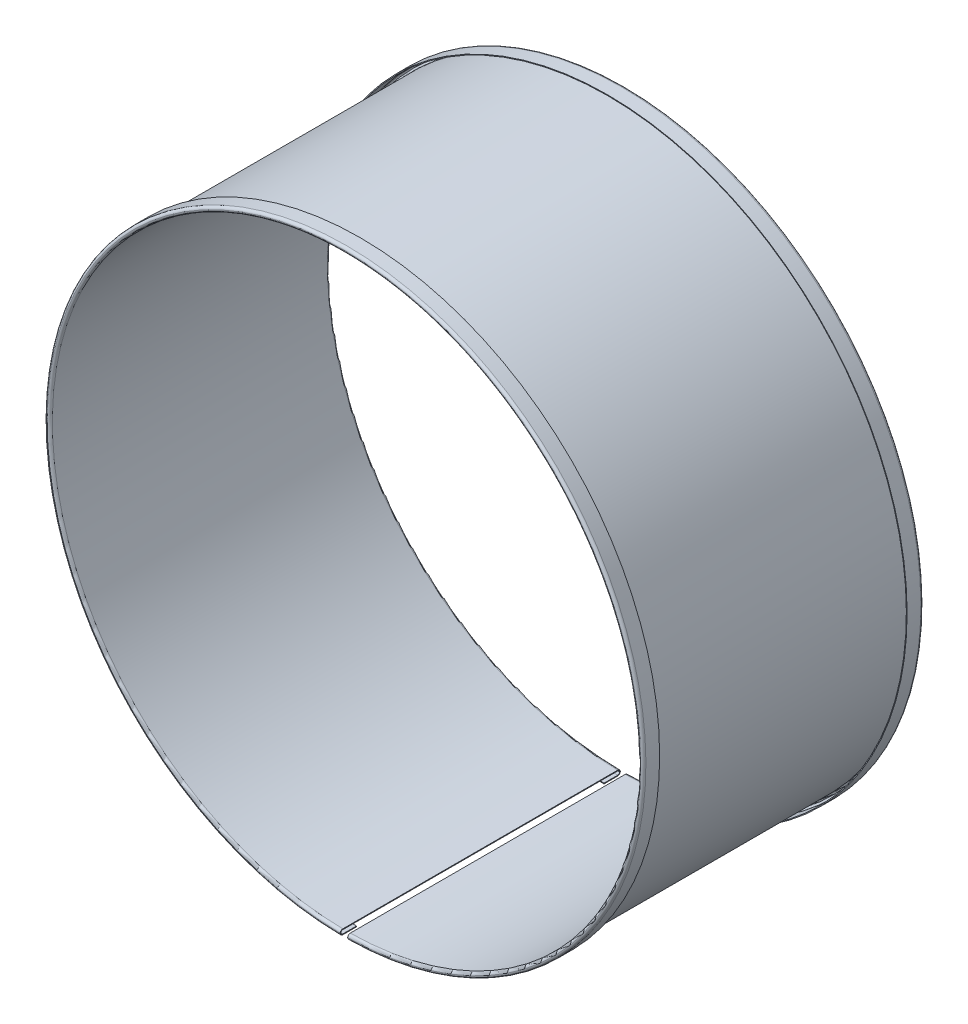
ISO-10303-21;
HEADER;
FILE_DESCRIPTION(('STEP AP214'),'2;1');
FILE_NAME('part.step','',(''),(''),'','','');
FILE_SCHEMA(('AUTOMOTIVE_DESIGN { 1 0 10303 214 1 1 1 1 }'));
ENDSEC;
DATA;
#1=APPLICATION_CONTEXT('core data for automotive mechanical design processes');
#2=APPLICATION_PROTOCOL_DEFINITION('international standard','automotive_design',2000,#1);
#3=PRODUCT_CONTEXT('',#1,'mechanical');
#4=PRODUCT('Part','Part','',(#3));
#5=PRODUCT_RELATED_PRODUCT_CATEGORY('part','',(#4));
#6=PRODUCT_DEFINITION_FORMATION('','',#4);
#7=PRODUCT_DEFINITION_CONTEXT('part definition',#1,'design');
#8=PRODUCT_DEFINITION('design','',#6,#7);
#9=PRODUCT_DEFINITION_SHAPE('','',#8);
#10=(LENGTH_UNIT() NAMED_UNIT(*) SI_UNIT(.MILLI.,.METRE.));
#11=(NAMED_UNIT(*) PLANE_ANGLE_UNIT() SI_UNIT($,.RADIAN.));
#12=(NAMED_UNIT(*) SI_UNIT($,.STERADIAN.) SOLID_ANGLE_UNIT());
#13=UNCERTAINTY_MEASURE_WITH_UNIT(LENGTH_MEASURE(1.E-05),#10,'distance_accuracy_value','');
#14=(GEOMETRIC_REPRESENTATION_CONTEXT(3) GLOBAL_UNCERTAINTY_ASSIGNED_CONTEXT((#13)) GLOBAL_UNIT_ASSIGNED_CONTEXT((#10,
#11,#12)) REPRESENTATION_CONTEXT('',''));
#15=CARTESIAN_POINT('',(0.,0.,0.));
#16=DIRECTION('',(0.,0.,1.));
#17=DIRECTION('',(1.,0.,0.));
#18=AXIS2_PLACEMENT_3D('',#15,#16,#17);
#19=CARTESIAN_POINT('',(2.01259615598009,-159.765923063494,-74.));
#20=DIRECTION('',(-0.999920665280262,-0.012596155980198,0.));
#21=DIRECTION('',(0.012596155980198,-0.999920665280262,0.));
#22=AXIS2_PLACEMENT_3D('',#19,#20,#21);
#23=PLANE('',#22);
#24=DIRECTION('',(0.0125961559801985,-0.999920665280262,0.));
#25=VECTOR('',#24,1.);
#26=CARTESIAN_POINT('',(2.02519231196033,-160.765843728774,-74.));
#27=LINE('',#26,#25);
#28=CARTESIAN_POINT('',(2.02519231196033,-160.765843728774,-74.));
#29=VERTEX_POINT('',#28);
#30=CARTESIAN_POINT('',(2.03023077435238,-161.165811994887,-74.));
#31=VERTEX_POINT('',#30);
#32=EDGE_CURVE('E11',#29,#31,#27,.T.);
#33=ORIENTED_EDGE('',*,*,#32,.F.);
#34=CARTESIAN_POINT('',(2.01259615598009,-159.765923063494,-74.));
#35=DIRECTION('',(0.999920665280262,0.012596155980198,0.));
#36=DIRECTION('',(-0.012596155980198,0.999920665280262,0.));
#37=AXIS2_PLACEMENT_3D('',#34,#35,#36);
#38=CIRCLE('',#37,1.);
#39=CARTESIAN_POINT('',(2.01259615598013,-159.765923063494,-75.));
#40=VERTEX_POINT('',#39);
#41=EDGE_CURVE('E182',#40,#29,#38,.F.);
#42=ORIENTED_EDGE('',*,*,#41,.F.);
#43=DIRECTION('',(0.,0.,-1.));
#44=VECTOR('',#43,1.);
#45=CARTESIAN_POINT('',(2.01259615598013,-159.765923063494,-75.));
#46=LINE('',#45,#44);
#47=CARTESIAN_POINT('',(2.0125961559801,-159.765923063494,-75.4));
#48=VERTEX_POINT('',#47);
#49=EDGE_CURVE('E47',#40,#48,#46,.T.);
#50=ORIENTED_EDGE('',*,*,#49,.T.);
#51=CARTESIAN_POINT('',(2.0125961559801,-159.765923063494,-74.));
#52=DIRECTION('',(0.999920665280262,0.0125961559801982,0.));
#53=DIRECTION('',(-0.0125961559801982,0.999920665280262,0.));
#54=AXIS2_PLACEMENT_3D('',#51,#52,#53);
#55=CIRCLE('',#54,1.4);
#56=EDGE_CURVE('E179',#48,#31,#55,.F.);
#57=ORIENTED_EDGE('',*,*,#56,.T.);
#58=EDGE_LOOP('',(#33,#42,#50,#57));
#59=FACE_BOUND('',#58,.T.);
#60=ADVANCED_FACE('F37',(#59),#23,.T.);
#61=CARTESIAN_POINT('',(2.01259615598009,-159.765923063494,-74.));
#62=DIRECTION('',(-0.999920665280262,-0.012596155980198,0.));
#63=DIRECTION('',(0.012596155980198,-0.999920665280262,0.));
#64=AXIS2_PLACEMENT_3D('',#61,#62,#63);
#65=PLANE('',#64);
#66=ORIENTED_EDGE('',*,*,#49,.F.);
#67=CARTESIAN_POINT('',(2.01259615598009,-159.765923063494,-74.));
#68=DIRECTION('',(0.999920665280262,0.012596155980198,0.));
#69=DIRECTION('',(-0.012596155980198,0.999920665280262,0.));
#70=AXIS2_PLACEMENT_3D('',#67,#68,#69);
#71=CIRCLE('',#70,1.);
#72=CARTESIAN_POINT('',(1.99999999999993,-158.766002398214,-74.));
#73=VERTEX_POINT('',#72);
#74=EDGE_CURVE('E294',#73,#40,#71,.F.);
#75=ORIENTED_EDGE('',*,*,#74,.F.);
#76=DIRECTION('',(-0.0125961559801984,0.999920665280262,0.));
#77=VECTOR('',#76,1.);
#78=CARTESIAN_POINT('',(1.99999999999993,-158.766002398214,-74.));
#79=LINE('',#78,#77);
#80=CARTESIAN_POINT('',(1.99496153760783,-158.366034132102,-74.));
#81=VERTEX_POINT('',#80);
#82=EDGE_CURVE('E171',#73,#81,#79,.T.);
#83=ORIENTED_EDGE('',*,*,#82,.T.);
#84=CARTESIAN_POINT('',(2.0125961559801,-159.765923063494,-74.));
#85=DIRECTION('',(0.999920665280262,0.0125961559801982,0.));
#86=DIRECTION('',(-0.0125961559801982,0.999920665280262,0.));
#87=AXIS2_PLACEMENT_3D('',#84,#85,#86);
#88=CIRCLE('',#87,1.4);
#89=EDGE_CURVE('E199',#81,#48,#88,.F.);
#90=ORIENTED_EDGE('',*,*,#89,.T.);
#91=EDGE_LOOP('',(#66,#75,#83,#90));
#92=FACE_BOUND('',#91,.T.);
#93=ADVANCED_FACE('F200',(#92),#65,.T.);
#94=CARTESIAN_POINT('',(1.9999999999999,-158.766002398214,0.));
#95=DIRECTION('',(-0.999920665280262,-0.0125961559801982,0.));
#96=DIRECTION('',(0.,0.,-1.));
#97=AXIS2_PLACEMENT_3D('',#94,#95,#96);
#98=PLANE('',#97);
#99=ORIENTED_EDGE('',*,*,#82,.F.);
#100=DIRECTION('',(0.,0.,-1.));
#101=VECTOR('',#100,1.);
#102=CARTESIAN_POINT('',(1.9999999999999,-158.766002398214,75.));
#103=LINE('',#102,#101);
#104=CARTESIAN_POINT('',(1.99999999999993,-158.766002398214,74.));
#105=VERTEX_POINT('',#104);
#106=EDGE_CURVE('E285',#105,#73,#103,.T.);
#107=ORIENTED_EDGE('',*,*,#106,.F.);
#108=DIRECTION('',(-0.0125961559801984,0.999920665280262,0.));
#109=VECTOR('',#108,1.);
#110=CARTESIAN_POINT('',(1.99999999999993,-158.766002398214,74.));
#111=LINE('',#110,#109);
#112=CARTESIAN_POINT('',(1.99496153760783,-158.366034132102,74.));
#113=VERTEX_POINT('',#112);
#114=EDGE_CURVE('E168',#105,#113,#111,.T.);
#115=ORIENTED_EDGE('',*,*,#114,.T.);
#116=DIRECTION('',(0.,0.,-1.));
#117=VECTOR('',#116,1.);
#118=CARTESIAN_POINT('',(1.99496153760783,-158.366034132102,0.));
#119=LINE('',#118,#117);
#120=EDGE_CURVE('E216',#113,#81,#119,.T.);
#121=ORIENTED_EDGE('',*,*,#120,.T.);
#122=EDGE_LOOP('',(#99,#107,#115,#121));
#123=FACE_BOUND('',#122,.T.);
#124=ADVANCED_FACE('F330',(#123),#98,.T.);
#125=CARTESIAN_POINT('',(2.01259615598009,-159.765923063494,74.));
#126=DIRECTION('',(-0.999920665280262,-0.0125961559801981,0.));
#127=DIRECTION('',(0.0125961559801981,-0.999920665280262,0.));
#128=AXIS2_PLACEMENT_3D('',#125,#126,#127);
#129=PLANE('',#128);
#130=ORIENTED_EDGE('',*,*,#114,.F.);
#131=CARTESIAN_POINT('',(2.01259615598009,-159.765923063494,74.));
#132=DIRECTION('',(0.999920665280262,0.0125961559801981,0.));
#133=DIRECTION('',(-0.0125961559801981,0.999920665280262,0.));
#134=AXIS2_PLACEMENT_3D('',#131,#132,#133);
#135=CIRCLE('',#134,1.);
#136=CARTESIAN_POINT('',(2.01259615598013,-159.765923063494,75.));
#137=VERTEX_POINT('',#136);
#138=EDGE_CURVE('E276',#137,#105,#135,.F.);
#139=ORIENTED_EDGE('',*,*,#138,.F.);
#140=DIRECTION('',(0.,0.,1.));
#141=VECTOR('',#140,1.);
#142=CARTESIAN_POINT('',(2.01259615598013,-159.765923063494,75.));
#143=LINE('',#142,#141);
#144=CARTESIAN_POINT('',(2.01259615598011,-159.765923063494,75.4));
#145=VERTEX_POINT('',#144);
#146=EDGE_CURVE('E165',#137,#145,#143,.T.);
#147=ORIENTED_EDGE('',*,*,#146,.T.);
#148=CARTESIAN_POINT('',(2.0125961559801,-159.765923063494,74.));
#149=DIRECTION('',(0.999920665280262,0.0125961559801982,0.));
#150=DIRECTION('',(-0.0125961559801982,0.999920665280262,0.));
#151=AXIS2_PLACEMENT_3D('',#148,#149,#150);
#152=CIRCLE('',#151,1.4);
#153=EDGE_CURVE('E220',#145,#113,#152,.F.);
#154=ORIENTED_EDGE('',*,*,#153,.T.);
#155=EDGE_LOOP('',(#130,#139,#147,#154));
#156=FACE_BOUND('',#155,.T.);
#157=ADVANCED_FACE('F338',(#156),#129,.T.);
#158=CARTESIAN_POINT('',(2.01259615598009,-159.765923063494,74.));
#159=DIRECTION('',(-0.999920665280262,-0.0125961559801981,0.));
#160=DIRECTION('',(0.0125961559801981,-0.999920665280262,0.));
#161=AXIS2_PLACEMENT_3D('',#158,#159,#160);
#162=PLANE('',#161);
#163=ORIENTED_EDGE('',*,*,#146,.F.);
#164=CARTESIAN_POINT('',(2.01259615598009,-159.765923063494,74.));
#165=DIRECTION('',(0.999920665280262,0.0125961559801981,0.));
#166=DIRECTION('',(-0.0125961559801981,0.999920665280262,0.));
#167=AXIS2_PLACEMENT_3D('',#164,#165,#166);
#168=CIRCLE('',#167,1.);
#169=CARTESIAN_POINT('',(2.02519231196033,-160.765843728774,74.));
#170=VERTEX_POINT('',#169);
#171=EDGE_CURVE('E265',#170,#137,#168,.F.);
#172=ORIENTED_EDGE('',*,*,#171,.F.);
#173=DIRECTION('',(0.0125961559801984,-0.999920665280262,0.));
#174=VECTOR('',#173,1.);
#175=CARTESIAN_POINT('',(2.02519231196033,-160.765843728774,74.));
#176=LINE('',#175,#174);
#177=CARTESIAN_POINT('',(2.03023077435238,-161.165811994887,74.));
#178=VERTEX_POINT('',#177);
#179=EDGE_CURVE('E162',#170,#178,#176,.T.);
#180=ORIENTED_EDGE('',*,*,#179,.T.);
#181=CARTESIAN_POINT('',(2.0125961559801,-159.765923063494,74.));
#182=DIRECTION('',(0.999920665280262,0.0125961559801982,0.));
#183=DIRECTION('',(-0.0125961559801982,0.999920665280262,0.));
#184=AXIS2_PLACEMENT_3D('',#181,#182,#183);
#185=CIRCLE('',#184,1.4);
#186=EDGE_CURVE('E224',#178,#145,#185,.F.);
#187=ORIENTED_EDGE('',*,*,#186,.T.);
#188=EDGE_LOOP('',(#163,#172,#180,#187));
#189=FACE_BOUND('',#188,.T.);
#190=ADVANCED_FACE('F374',(#189),#162,.T.);
#191=CARTESIAN_POINT('',(2.02519231196029,-160.765843728774,70.305));
#192=DIRECTION('',(0.999920665280262,0.0125961559801982,0.));
#193=DIRECTION('',(0.,0.,1.));
#194=AXIS2_PLACEMENT_3D('',#191,#192,#193);
#195=PLANE('',#194);
#196=ORIENTED_EDGE('',*,*,#179,.F.);
#197=DIRECTION('',(0.,0.,1.));
#198=VECTOR('',#197,1.);
#199=CARTESIAN_POINT('',(2.02519231196029,-160.765843728774,75.));
#200=LINE('',#199,#198);
#201=CARTESIAN_POINT('',(2.02519231196033,-160.765843728774,66.61));
#202=VERTEX_POINT('',#201);
#203=EDGE_CURVE('E259',#202,#170,#200,.T.);
#204=ORIENTED_EDGE('',*,*,#203,.F.);
#205=DIRECTION('',(0.0125961559801984,-0.999920665280262,0.));
#206=VECTOR('',#205,1.);
#207=CARTESIAN_POINT('',(2.02519231196033,-160.765843728774,66.61));
#208=LINE('',#207,#206);
#209=CARTESIAN_POINT('',(2.03023077435238,-161.165811994887,66.61));
#210=VERTEX_POINT('',#209);
#211=EDGE_CURVE('E159',#202,#210,#208,.T.);
#212=ORIENTED_EDGE('',*,*,#211,.T.);
#213=DIRECTION('',(0.,0.,-1.));
#214=VECTOR('',#213,1.);
#215=CARTESIAN_POINT('',(2.03023077435238,-161.165811994887,0.));
#216=LINE('',#215,#214);
#217=EDGE_CURVE('E228',#210,#178,#216,.F.);
#218=ORIENTED_EDGE('',*,*,#217,.T.);
#219=EDGE_LOOP('',(#196,#204,#212,#218));
#220=FACE_BOUND('',#219,.T.);
#221=ADVANCED_FACE('F404',(#220),#195,.F.);
#222=CARTESIAN_POINT('',(0.,0.,66.61));
#223=DIRECTION('',(0.,0.,1.));
#224=DIRECTION('',(1.,0.,0.));
#225=AXIS2_PLACEMENT_3D('',#222,#223,#224);
#226=PLANE('',#225);
#227=ORIENTED_EDGE('',*,*,#211,.F.);
#228=CARTESIAN_POINT('',(0.,0.,66.61));
#229=DIRECTION('',(0.,0.,-1.));
#230=DIRECTION('',(-0.0125961559801988,-0.999920665280262,0.));
#231=AXIS2_PLACEMENT_3D('',#228,#229,#230);
#232=CIRCLE('',#231,160.77859905387);
#233=CARTESIAN_POINT('',(-2.0251923119604,-160.765843728774,66.61));
#234=VERTEX_POINT('',#233);
#235=EDGE_CURVE('E125',#234,#202,#232,.T.);
#236=ORIENTED_EDGE('',*,*,#235,.F.);
#237=DIRECTION('',(-0.0125961559801988,-0.999920665280262,0.));
#238=VECTOR('',#237,1.);
#239=CARTESIAN_POINT('',(-2.0251923119604,-160.765843728774,66.61));
#240=LINE('',#239,#238);
#241=CARTESIAN_POINT('',(-2.03023077435247,-161.165811994887,66.61));
#242=VERTEX_POINT('',#241);
#243=EDGE_CURVE('E156',#234,#242,#240,.T.);
#244=ORIENTED_EDGE('',*,*,#243,.T.);
#245=CARTESIAN_POINT('',(0.,0.,66.61));
#246=DIRECTION('',(0.,0.,-1.));
#247=DIRECTION('',(-1.,0.,0.));
#248=AXIS2_PLACEMENT_3D('',#245,#246,#247);
#249=CIRCLE('',#248,161.17859905387);
#250=EDGE_CURVE('E233',#242,#210,#249,.T.);
#251=ORIENTED_EDGE('',*,*,#250,.T.);
#252=EDGE_LOOP('',(#227,#236,#244,#251));
#253=FACE_BOUND('',#252,.T.);
#254=ADVANCED_FACE('F407',(#253),#226,.F.);
#255=CARTESIAN_POINT('',(-2.0251923119604,-160.765843728774,70.305));
#256=DIRECTION('',(0.999920665280262,-0.0125961559801988,0.));
#257=DIRECTION('',(0.,0.,1.));
#258=AXIS2_PLACEMENT_3D('',#255,#256,#257);
#259=PLANE('',#258);
#260=ORIENTED_EDGE('',*,*,#243,.F.);
#261=DIRECTION('',(0.,0.,1.));
#262=VECTOR('',#261,1.);
#263=CARTESIAN_POINT('',(-2.0251923119604,-160.765843728774,75.));
#264=LINE('',#263,#262);
#265=CARTESIAN_POINT('',(-2.0251923119604,-160.765843728774,74.));
#266=VERTEX_POINT('',#265);
#267=EDGE_CURVE('E255',#234,#266,#264,.T.);
#268=ORIENTED_EDGE('',*,*,#267,.T.);
#269=DIRECTION('',(-0.0125961559801989,-0.999920665280262,0.));
#270=VECTOR('',#269,1.);
#271=CARTESIAN_POINT('',(-2.0251923119604,-160.765843728774,74.));
#272=LINE('',#271,#270);
#273=CARTESIAN_POINT('',(-2.03023077435247,-161.165811994887,74.));
#274=VERTEX_POINT('',#273);
#275=EDGE_CURVE('E153',#266,#274,#272,.T.);
#276=ORIENTED_EDGE('',*,*,#275,.T.);
#277=DIRECTION('',(0.,0.,-1.));
#278=VECTOR('',#277,1.);
#279=CARTESIAN_POINT('',(-2.03023077435247,-161.165811994887,0.));
#280=LINE('',#279,#278);
#281=EDGE_CURVE('E132',#242,#274,#280,.F.);
#282=ORIENTED_EDGE('',*,*,#281,.F.);
#283=EDGE_LOOP('',(#260,#268,#276,#282));
#284=FACE_BOUND('',#283,.T.);
#285=ADVANCED_FACE('F390',(#284),#259,.T.);
#286=CARTESIAN_POINT('',(-2.0125961559802,-159.765923063494,74.));
#287=DIRECTION('',(-0.999920665280262,0.0125961559801989,0.));
#288=DIRECTION('',(-0.0125961559801989,-0.999920665280262,0.));
#289=AXIS2_PLACEMENT_3D('',#286,#287,#288);
#290=PLANE('',#289);
#291=ORIENTED_EDGE('',*,*,#275,.F.);
#292=CARTESIAN_POINT('',(-2.0125961559802,-159.765923063494,74.));
#293=DIRECTION('',(0.999920665280262,-0.0125961559801989,0.));
#294=DIRECTION('',(0.0125961559801989,0.999920665280262,0.));
#295=AXIS2_PLACEMENT_3D('',#292,#293,#294);
#296=CIRCLE('',#295,1.);
#297=CARTESIAN_POINT('',(-2.0125961559802,-159.765923063494,75.));
#298=VERTEX_POINT('',#297);
#299=EDGE_CURVE('E258',#266,#298,#296,.F.);
#300=ORIENTED_EDGE('',*,*,#299,.T.);
#301=DIRECTION('',(0.,0.,1.));
#302=VECTOR('',#301,1.);
#303=CARTESIAN_POINT('',(-2.0125961559802,-159.765923063494,75.));
#304=LINE('',#303,#302);
#305=CARTESIAN_POINT('',(-2.01259615598019,-159.765923063494,75.4));
#306=VERTEX_POINT('',#305);
#307=EDGE_CURVE('E150',#298,#306,#304,.T.);
#308=ORIENTED_EDGE('',*,*,#307,.T.);
#309=CARTESIAN_POINT('',(-2.01259615598019,-159.765923063494,74.));
#310=DIRECTION('',(0.999920665280262,-0.0125961559801988,0.));
#311=DIRECTION('',(0.0125961559801988,0.999920665280262,0.));
#312=AXIS2_PLACEMENT_3D('',#309,#310,#311);
#313=CIRCLE('',#312,1.4);
#314=EDGE_CURVE('E135',#274,#306,#313,.F.);
#315=ORIENTED_EDGE('',*,*,#314,.F.);
#316=EDGE_LOOP('',(#291,#300,#308,#315));
#317=FACE_BOUND('',#316,.T.);
#318=ADVANCED_FACE('F381',(#317),#290,.F.);
#319=CARTESIAN_POINT('',(-2.0125961559802,-159.765923063494,74.));
#320=DIRECTION('',(-0.999920665280262,0.0125961559801989,0.));
#321=DIRECTION('',(-0.0125961559801989,-0.999920665280262,0.));
#322=AXIS2_PLACEMENT_3D('',#319,#320,#321);
#323=PLANE('',#322);
#324=ORIENTED_EDGE('',*,*,#307,.F.);
#325=CARTESIAN_POINT('',(-2.0125961559802,-159.765923063494,74.));
#326=DIRECTION('',(0.999920665280262,-0.0125961559801989,0.));
#327=DIRECTION('',(0.0125961559801989,0.999920665280262,0.));
#328=AXIS2_PLACEMENT_3D('',#325,#326,#327);
#329=CIRCLE('',#328,1.);
#330=CARTESIAN_POINT('',(-2.,-158.766002398214,74.));
#331=VERTEX_POINT('',#330);
#332=EDGE_CURVE('E270',#298,#331,#329,.F.);
#333=ORIENTED_EDGE('',*,*,#332,.T.);
#334=DIRECTION('',(0.0125961559801988,0.999920665280262,0.));
#335=VECTOR('',#334,1.);
#336=CARTESIAN_POINT('',(-2.,-158.766002398214,74.));
#337=LINE('',#336,#335);
#338=CARTESIAN_POINT('',(-1.99496153760791,-158.366034132102,74.));
#339=VERTEX_POINT('',#338);
#340=EDGE_CURVE('E147',#331,#339,#337,.T.);
#341=ORIENTED_EDGE('',*,*,#340,.T.);
#342=CARTESIAN_POINT('',(-2.01259615598019,-159.765923063494,74.));
#343=DIRECTION('',(0.999920665280262,-0.0125961559801988,0.));
#344=DIRECTION('',(0.0125961559801988,0.999920665280262,0.));
#345=AXIS2_PLACEMENT_3D('',#342,#343,#344);
#346=CIRCLE('',#345,1.4);
#347=EDGE_CURVE('E240',#306,#339,#346,.F.);
#348=ORIENTED_EDGE('',*,*,#347,.F.);
#349=EDGE_LOOP('',(#324,#333,#341,#348));
#350=FACE_BOUND('',#349,.T.);
#351=ADVANCED_FACE('F382',(#350),#323,.F.);
#352=CARTESIAN_POINT('',(-2.,-158.766002398214,0.));
#353=DIRECTION('',(-0.999920665280262,0.0125961559801988,0.));
#354=DIRECTION('',(0.,0.,-1.));
#355=AXIS2_PLACEMENT_3D('',#352,#353,#354);
#356=PLANE('',#355);
#357=ORIENTED_EDGE('',*,*,#340,.F.);
#358=DIRECTION('',(0.,0.,-1.));
#359=VECTOR('',#358,1.);
#360=CARTESIAN_POINT('',(-2.,-158.766002398214,75.));
#361=LINE('',#360,#359);
#362=CARTESIAN_POINT('',(-2.,-158.766002398214,-74.));
#363=VERTEX_POINT('',#362);
#364=EDGE_CURVE('E279',#331,#363,#361,.T.);
#365=ORIENTED_EDGE('',*,*,#364,.T.);
#366=DIRECTION('',(0.0125961559801989,0.999920665280262,0.));
#367=VECTOR('',#366,1.);
#368=CARTESIAN_POINT('',(-2.,-158.766002398214,-74.));
#369=LINE('',#368,#367);
#370=CARTESIAN_POINT('',(-1.99496153760791,-158.366034132102,-74.));
#371=VERTEX_POINT('',#370);
#372=EDGE_CURVE('E144',#363,#371,#369,.T.);
#373=ORIENTED_EDGE('',*,*,#372,.T.);
#374=DIRECTION('',(0.,0.,-1.));
#375=VECTOR('',#374,1.);
#376=CARTESIAN_POINT('',(-1.99496153760791,-158.366034132102,0.));
#377=LINE('',#376,#375);
#378=EDGE_CURVE('E237',#339,#371,#377,.T.);
#379=ORIENTED_EDGE('',*,*,#378,.F.);
#380=EDGE_LOOP('',(#357,#365,#373,#379));
#381=FACE_BOUND('',#380,.T.);
#382=ADVANCED_FACE('F348',(#381),#356,.F.);
#383=CARTESIAN_POINT('',(-2.0125961559802,-159.765923063494,-74.));
#384=DIRECTION('',(-0.999920665280262,0.012596155980199,0.));
#385=DIRECTION('',(-0.012596155980199,-0.999920665280262,0.));
#386=AXIS2_PLACEMENT_3D('',#383,#384,#385);
#387=PLANE('',#386);
#388=ORIENTED_EDGE('',*,*,#372,.F.);
#389=CARTESIAN_POINT('',(-2.0125961559802,-159.765923063494,-74.));
#390=DIRECTION('',(0.999920665280262,-0.012596155980199,0.));
#391=DIRECTION('',(0.012596155980199,0.999920665280262,0.));
#392=AXIS2_PLACEMENT_3D('',#389,#390,#391);
#393=CIRCLE('',#392,1.);
#394=CARTESIAN_POINT('',(-2.0125961559802,-159.765923063494,-75.));
#395=VERTEX_POINT('',#394);
#396=EDGE_CURVE('E288',#363,#395,#393,.F.);
#397=ORIENTED_EDGE('',*,*,#396,.T.);
#398=DIRECTION('',(0.,0.,-1.));
#399=VECTOR('',#398,1.);
#400=CARTESIAN_POINT('',(-2.0125961559802,-159.765923063494,-75.));
#401=LINE('',#400,#399);
#402=CARTESIAN_POINT('',(-2.01259615598019,-159.765923063494,-75.4));
#403=VERTEX_POINT('',#402);
#404=EDGE_CURVE('E141',#395,#403,#401,.T.);
#405=ORIENTED_EDGE('',*,*,#404,.T.);
#406=CARTESIAN_POINT('',(-2.01259615598019,-159.765923063494,-74.));
#407=DIRECTION('',(0.999920665280262,-0.0125961559801988,0.));
#408=DIRECTION('',(0.0125961559801988,0.999920665280262,0.));
#409=AXIS2_PLACEMENT_3D('',#406,#407,#408);
#410=CIRCLE('',#409,1.4);
#411=EDGE_CURVE('E209',#371,#403,#410,.F.);
#412=ORIENTED_EDGE('',*,*,#411,.F.);
#413=EDGE_LOOP('',(#388,#397,#405,#412));
#414=FACE_BOUND('',#413,.T.);
#415=ADVANCED_FACE('F352',(#414),#387,.F.);
#416=CARTESIAN_POINT('',(-2.0125961559802,-159.765923063494,-74.));
#417=DIRECTION('',(-0.999920665280262,0.012596155980199,0.));
#418=DIRECTION('',(-0.012596155980199,-0.999920665280262,0.));
#419=AXIS2_PLACEMENT_3D('',#416,#417,#418);
#420=PLANE('',#419);
#421=ORIENTED_EDGE('',*,*,#404,.F.);
#422=CARTESIAN_POINT('',(-2.0125961559802,-159.765923063494,-74.));
#423=DIRECTION('',(0.999920665280262,-0.012596155980199,0.));
#424=DIRECTION('',(0.012596155980199,0.999920665280262,0.));
#425=AXIS2_PLACEMENT_3D('',#422,#423,#424);
#426=CIRCLE('',#425,1.);
#427=CARTESIAN_POINT('',(-2.0251923119604,-160.765843728774,-74.));
#428=VERTEX_POINT('',#427);
#429=EDGE_CURVE('E126',#395,#428,#426,.F.);
#430=ORIENTED_EDGE('',*,*,#429,.T.);
#431=DIRECTION('',(-0.0125961559801988,-0.999920665280262,0.));
#432=VECTOR('',#431,1.);
#433=CARTESIAN_POINT('',(-2.0251923119604,-160.765843728774,-74.));
#434=LINE('',#433,#432);
#435=CARTESIAN_POINT('',(-2.03023077435247,-161.165811994887,-74.));
#436=VERTEX_POINT('',#435);
#437=EDGE_CURVE('E115',#428,#436,#434,.T.);
#438=ORIENTED_EDGE('',*,*,#437,.T.);
#439=CARTESIAN_POINT('',(-2.01259615598019,-159.765923063494,-74.));
#440=DIRECTION('',(0.999920665280262,-0.0125961559801988,0.));
#441=DIRECTION('',(0.0125961559801988,0.999920665280262,0.));
#442=AXIS2_PLACEMENT_3D('',#439,#440,#441);
#443=CIRCLE('',#442,1.4);
#444=EDGE_CURVE('E234',#403,#436,#443,.F.);
#445=ORIENTED_EDGE('',*,*,#444,.F.);
#446=EDGE_LOOP('',(#421,#430,#438,#445));
#447=FACE_BOUND('',#446,.T.);
#448=ADVANCED_FACE('F358',(#447),#420,.F.);
#449=CARTESIAN_POINT('',(-2.0251923119604,-160.765843728774,-70.305));
#450=DIRECTION('',(0.999920665280262,-0.0125961559801988,0.));
#451=DIRECTION('',(0.,0.,1.));
#452=AXIS2_PLACEMENT_3D('',#449,#450,#451);
#453=PLANE('',#452);
#454=ORIENTED_EDGE('',*,*,#437,.F.);
#455=DIRECTION('',(0.,0.,1.));
#456=VECTOR('',#455,1.);
#457=CARTESIAN_POINT('',(-2.0251923119604,-160.765843728774,-75.));
#458=LINE('',#457,#456);
#459=CARTESIAN_POINT('',(-2.0251923119604,-160.765843728774,-66.61));
#460=VERTEX_POINT('',#459);
#461=EDGE_CURVE('E118',#428,#460,#458,.T.);
#462=ORIENTED_EDGE('',*,*,#461,.T.);
#463=DIRECTION('',(-0.0125961559801988,-0.999920665280262,0.));
#464=VECTOR('',#463,1.);
#465=CARTESIAN_POINT('',(-2.0251923119604,-160.765843728774,-66.61));
#466=LINE('',#465,#464);
#467=CARTESIAN_POINT('',(-2.03023077435247,-161.165811994887,-66.61));
#468=VERTEX_POINT('',#467);
#469=EDGE_CURVE('E104',#460,#468,#466,.T.);
#470=ORIENTED_EDGE('',*,*,#469,.T.);
#471=DIRECTION('',(0.,0.,-1.));
#472=VECTOR('',#471,1.);
#473=CARTESIAN_POINT('',(-2.03023077435247,-161.165811994887,0.));
#474=LINE('',#473,#472);
#475=EDGE_CURVE('E231',#436,#468,#474,.F.);
#476=ORIENTED_EDGE('',*,*,#475,.F.);
#477=EDGE_LOOP('',(#454,#462,#470,#476));
#478=FACE_BOUND('',#477,.T.);
#479=ADVANCED_FACE('F119',(#478),#453,.T.);
#480=CARTESIAN_POINT('',(0.,0.,-66.61));
#481=DIRECTION('',(0.,0.,1.));
#482=DIRECTION('',(1.,0.,0.));
#483=AXIS2_PLACEMENT_3D('',#480,#481,#482);
#484=PLANE('',#483);
#485=ORIENTED_EDGE('',*,*,#469,.F.);
#486=CARTESIAN_POINT('',(0.,0.,-66.61));
#487=DIRECTION('',(0.,0.,-1.));
#488=DIRECTION('',(-0.0125961559801988,-0.999920665280262,0.));
#489=AXIS2_PLACEMENT_3D('',#486,#487,#488);
#490=CIRCLE('',#489,160.77859905387);
#491=CARTESIAN_POINT('',(2.02519231196033,-160.765843728774,-66.61));
#492=VERTEX_POINT('',#491);
#493=EDGE_CURVE('E108',#460,#492,#490,.T.);
#494=ORIENTED_EDGE('',*,*,#493,.T.);
#495=DIRECTION('',(0.0125961559801984,-0.999920665280262,0.));
#496=VECTOR('',#495,1.);
#497=CARTESIAN_POINT('',(2.02519231196033,-160.765843728774,-66.61));
#498=LINE('',#497,#496);
#499=CARTESIAN_POINT('',(2.03023077435238,-161.165811994887,-66.61));
#500=VERTEX_POINT('',#499);
#501=EDGE_CURVE('E41',#492,#500,#498,.T.);
#502=ORIENTED_EDGE('',*,*,#501,.T.);
#503=CARTESIAN_POINT('',(0.,0.,-66.61));
#504=DIRECTION('',(0.,0.,-1.));
#505=DIRECTION('',(-1.,0.,0.));
#506=AXIS2_PLACEMENT_3D('',#503,#504,#505);
#507=CIRCLE('',#506,161.17859905387);
#508=EDGE_CURVE('E111',#468,#500,#507,.T.);
#509=ORIENTED_EDGE('',*,*,#508,.F.);
#510=EDGE_LOOP('',(#485,#494,#502,#509));
#511=FACE_BOUND('',#510,.T.);
#512=ADVANCED_FACE('F106',(#511),#484,.T.);
#513=CARTESIAN_POINT('',(2.02519231196029,-160.765843728774,-70.305));
#514=DIRECTION('',(0.999920665280262,0.0125961559801982,0.));
#515=DIRECTION('',(0.,0.,1.));
#516=AXIS2_PLACEMENT_3D('',#513,#514,#515);
#517=PLANE('',#516);
#518=DIRECTION('',(0.,0.,1.));
#519=VECTOR('',#518,1.);
#520=CARTESIAN_POINT('',(2.02519231196029,-160.765843728774,-75.));
#521=LINE('',#520,#519);
#522=EDGE_CURVE('E131',#29,#492,#521,.T.);
#523=ORIENTED_EDGE('',*,*,#522,.F.);
#524=ORIENTED_EDGE('',*,*,#32,.T.);
#525=DIRECTION('',(0.,0.,-1.));
#526=VECTOR('',#525,1.);
#527=CARTESIAN_POINT('',(2.03023077435238,-161.165811994887,0.));
#528=LINE('',#527,#526);
#529=EDGE_CURVE('E230',#31,#500,#528,.F.);
#530=ORIENTED_EDGE('',*,*,#529,.T.);
#531=ORIENTED_EDGE('',*,*,#501,.F.);
#532=EDGE_LOOP('',(#523,#524,#530,#531));
#533=FACE_BOUND('',#532,.T.);
#534=ADVANCED_FACE('F39',(#533),#517,.F.);
#535=CARTESIAN_POINT('',(0.,0.,0.));
#536=DIRECTION('',(0.,0.,-1.));
#537=DIRECTION('',(-1.,0.,0.));
#538=AXIS2_PLACEMENT_3D('',#535,#536,#537);
#539=CYLINDRICAL_SURFACE('',#538,161.17859905387);
#540=ORIENTED_EDGE('',*,*,#508,.T.);
#541=ORIENTED_EDGE('',*,*,#529,.F.);
#542=CARTESIAN_POINT('',(0.,0.,-74.));
#543=DIRECTION('',(0.,0.,-1.));
#544=DIRECTION('',(-1.,0.,0.));
#545=AXIS2_PLACEMENT_3D('',#542,#543,#544);
#546=CIRCLE('',#545,161.17859905387);
#547=EDGE_CURVE('E196',#436,#31,#546,.T.);
#548=ORIENTED_EDGE('',*,*,#547,.F.);
#549=ORIENTED_EDGE('',*,*,#475,.T.);
#550=EDGE_LOOP('',(#540,#541,#548,#549));
#551=FACE_BOUND('',#550,.T.);
#552=ADVANCED_FACE('F474',(#551),#539,.T.);
#553=CARTESIAN_POINT('',(0.,0.,-74.));
#554=DIRECTION('',(0.,0.,-1.));
#555=DIRECTION('',(-1.,0.,0.));
#556=AXIS2_PLACEMENT_3D('',#553,#554,#555);
#557=TOROIDAL_SURFACE('',#556,159.77859905387,1.4);
#558=ORIENTED_EDGE('',*,*,#547,.T.);
#559=ORIENTED_EDGE('',*,*,#56,.F.);
#560=CARTESIAN_POINT('',(0.,0.,-75.4));
#561=DIRECTION('',(0.,0.,-1.));
#562=DIRECTION('',(-1.,0.,0.));
#563=AXIS2_PLACEMENT_3D('',#560,#561,#562);
#564=CIRCLE('',#563,159.77859905387);
#565=EDGE_CURVE('E194',#403,#48,#564,.T.);
#566=ORIENTED_EDGE('',*,*,#565,.F.);
#567=ORIENTED_EDGE('',*,*,#444,.T.);
#568=EDGE_LOOP('',(#558,#559,#566,#567));
#569=FACE_BOUND('',#568,.T.);
#570=ADVANCED_FACE('F190',(#569),#557,.T.);
#571=CARTESIAN_POINT('',(0.,0.,-74.));
#572=DIRECTION('',(0.,0.,-1.));
#573=DIRECTION('',(-1.,0.,0.));
#574=AXIS2_PLACEMENT_3D('',#571,#572,#573);
#575=TOROIDAL_SURFACE('',#574,159.77859905387,1.4);
#576=ORIENTED_EDGE('',*,*,#565,.T.);
#577=ORIENTED_EDGE('',*,*,#89,.F.);
#578=CARTESIAN_POINT('',(0.,0.,-74.));
#579=DIRECTION('',(0.,0.,-1.));
#580=DIRECTION('',(-1.,0.,0.));
#581=AXIS2_PLACEMENT_3D('',#578,#579,#580);
#582=CIRCLE('',#581,158.37859905387);
#583=EDGE_CURVE('E204',#371,#81,#582,.T.);
#584=ORIENTED_EDGE('',*,*,#583,.F.);
#585=ORIENTED_EDGE('',*,*,#411,.T.);
#586=EDGE_LOOP('',(#576,#577,#584,#585));
#587=FACE_BOUND('',#586,.T.);
#588=ADVANCED_FACE('F207',(#587),#575,.T.);
#589=CARTESIAN_POINT('',(0.,0.,0.));
#590=DIRECTION('',(0.,0.,-1.));
#591=DIRECTION('',(-1.,0.,0.));
#592=AXIS2_PLACEMENT_3D('',#589,#590,#591);
#593=CYLINDRICAL_SURFACE('',#592,158.37859905387);
#594=ORIENTED_EDGE('',*,*,#583,.T.);
#595=ORIENTED_EDGE('',*,*,#120,.F.);
#596=CARTESIAN_POINT('',(0.,0.,74.));
#597=DIRECTION('',(0.,0.,-1.));
#598=DIRECTION('',(-1.,0.,0.));
#599=AXIS2_PLACEMENT_3D('',#596,#597,#598);
#600=CIRCLE('',#599,158.37859905387);
#601=EDGE_CURVE('E217',#339,#113,#600,.T.);
#602=ORIENTED_EDGE('',*,*,#601,.F.);
#603=ORIENTED_EDGE('',*,*,#378,.T.);
#604=EDGE_LOOP('',(#594,#595,#602,#603));
#605=FACE_BOUND('',#604,.T.);
#606=ADVANCED_FACE('F335',(#605),#593,.F.);
#607=CARTESIAN_POINT('',(0.,0.,74.));
#608=DIRECTION('',(0.,0.,-1.));
#609=DIRECTION('',(-1.,0.,0.));
#610=AXIS2_PLACEMENT_3D('',#607,#608,#609);
#611=TOROIDAL_SURFACE('',#610,159.77859905387,1.4);
#612=ORIENTED_EDGE('',*,*,#601,.T.);
#613=ORIENTED_EDGE('',*,*,#153,.F.);
#614=CARTESIAN_POINT('',(0.,0.,75.4));
#615=DIRECTION('',(0.,0.,-1.));
#616=DIRECTION('',(-1.,0.,0.));
#617=AXIS2_PLACEMENT_3D('',#614,#615,#616);
#618=CIRCLE('',#617,159.77859905387);
#619=EDGE_CURVE('E221',#306,#145,#618,.T.);
#620=ORIENTED_EDGE('',*,*,#619,.F.);
#621=ORIENTED_EDGE('',*,*,#347,.T.);
#622=EDGE_LOOP('',(#612,#613,#620,#621));
#623=FACE_BOUND('',#622,.T.);
#624=ADVANCED_FACE('F341',(#623),#611,.T.);
#625=CARTESIAN_POINT('',(0.,0.,74.));
#626=DIRECTION('',(0.,0.,-1.));
#627=DIRECTION('',(-1.,0.,0.));
#628=AXIS2_PLACEMENT_3D('',#625,#626,#627);
#629=TOROIDAL_SURFACE('',#628,159.77859905387,1.4);
#630=ORIENTED_EDGE('',*,*,#619,.T.);
#631=ORIENTED_EDGE('',*,*,#186,.F.);
#632=CARTESIAN_POINT('',(0.,0.,74.));
#633=DIRECTION('',(0.,0.,-1.));
#634=DIRECTION('',(-1.,0.,0.));
#635=AXIS2_PLACEMENT_3D('',#632,#633,#634);
#636=CIRCLE('',#635,161.17859905387);
#637=EDGE_CURVE('E225',#274,#178,#636,.T.);
#638=ORIENTED_EDGE('',*,*,#637,.F.);
#639=ORIENTED_EDGE('',*,*,#314,.T.);
#640=EDGE_LOOP('',(#630,#631,#638,#639));
#641=FACE_BOUND('',#640,.T.);
#642=ADVANCED_FACE('F378',(#641),#629,.T.);
#643=CARTESIAN_POINT('',(0.,0.,0.));
#644=DIRECTION('',(0.,0.,-1.));
#645=DIRECTION('',(-1.,0.,0.));
#646=AXIS2_PLACEMENT_3D('',#643,#644,#645);
#647=CYLINDRICAL_SURFACE('',#646,161.17859905387);
#648=ORIENTED_EDGE('',*,*,#637,.T.);
#649=ORIENTED_EDGE('',*,*,#217,.F.);
#650=ORIENTED_EDGE('',*,*,#250,.F.);
#651=ORIENTED_EDGE('',*,*,#281,.T.);
#652=EDGE_LOOP('',(#648,#649,#650,#651));
#653=FACE_BOUND('',#652,.T.);
#654=ADVANCED_FACE('F422',(#653),#647,.T.);
#655=CARTESIAN_POINT('',(0.,0.,0.));
#656=DIRECTION('',(0.,0.,-1.));
#657=DIRECTION('',(-1.,0.,0.));
#658=AXIS2_PLACEMENT_3D('',#655,#656,#657);
#659=CYLINDRICAL_SURFACE('',#658,160.77859905387);
#660=ORIENTED_EDGE('',*,*,#493,.F.);
#661=ORIENTED_EDGE('',*,*,#461,.F.);
#662=CARTESIAN_POINT('',(0.,0.,-74.));
#663=DIRECTION('',(0.,0.,-1.));
#664=DIRECTION('',(-0.0125961559801988,-0.999920665280262,0.));
#665=AXIS2_PLACEMENT_3D('',#662,#663,#664);
#666=CIRCLE('',#665,160.77859905387);
#667=EDGE_CURVE('E137',#428,#29,#666,.T.);
#668=ORIENTED_EDGE('',*,*,#667,.T.);
#669=ORIENTED_EDGE('',*,*,#522,.T.);
#670=EDGE_LOOP('',(#660,#661,#668,#669));
#671=FACE_BOUND('',#670,.T.);
#672=ADVANCED_FACE('F129',(#671),#659,.F.);
#673=CARTESIAN_POINT('',(0.,0.,-74.));
#674=DIRECTION('',(0.,0.,-1.));
#675=DIRECTION('',(-1.,0.,0.));
#676=AXIS2_PLACEMENT_3D('',#673,#674,#675);
#677=TOROIDAL_SURFACE('',#676,159.77859905387,1.);
#678=ORIENTED_EDGE('',*,*,#667,.F.);
#679=ORIENTED_EDGE('',*,*,#429,.F.);
#680=CARTESIAN_POINT('',(0.,0.,-75.));
#681=DIRECTION('',(0.,0.,-1.));
#682=DIRECTION('',(-0.0125961559801988,-0.999920665280262,0.));
#683=AXIS2_PLACEMENT_3D('',#680,#681,#682);
#684=CIRCLE('',#683,159.77859905387);
#685=EDGE_CURVE('E299',#395,#40,#684,.T.);
#686=ORIENTED_EDGE('',*,*,#685,.T.);
#687=ORIENTED_EDGE('',*,*,#41,.T.);
#688=EDGE_LOOP('',(#678,#679,#686,#687));
#689=FACE_BOUND('',#688,.T.);
#690=ADVANCED_FACE('F305',(#689),#677,.F.);
#691=CARTESIAN_POINT('',(0.,0.,-74.));
#692=DIRECTION('',(0.,0.,-1.));
#693=DIRECTION('',(-1.,0.,0.));
#694=AXIS2_PLACEMENT_3D('',#691,#692,#693);
#695=TOROIDAL_SURFACE('',#694,159.77859905387,1.);
#696=ORIENTED_EDGE('',*,*,#685,.F.);
#697=ORIENTED_EDGE('',*,*,#396,.F.);
#698=CARTESIAN_POINT('',(0.,0.,-74.));
#699=DIRECTION('',(0.,0.,-1.));
#700=DIRECTION('',(-0.0125961559801988,-0.999920665280262,0.));
#701=AXIS2_PLACEMENT_3D('',#698,#699,#700);
#702=CIRCLE('',#701,158.77859905387);
#703=EDGE_CURVE('E291',#363,#73,#702,.T.);
#704=ORIENTED_EDGE('',*,*,#703,.T.);
#705=ORIENTED_EDGE('',*,*,#74,.T.);
#706=EDGE_LOOP('',(#696,#697,#704,#705));
#707=FACE_BOUND('',#706,.T.);
#708=ADVANCED_FACE('F360',(#707),#695,.F.);
#709=CARTESIAN_POINT('',(0.,0.,0.));
#710=DIRECTION('',(0.,0.,-1.));
#711=DIRECTION('',(-1.,0.,0.));
#712=AXIS2_PLACEMENT_3D('',#709,#710,#711);
#713=CYLINDRICAL_SURFACE('',#712,158.77859905387);
#714=ORIENTED_EDGE('',*,*,#703,.F.);
#715=ORIENTED_EDGE('',*,*,#364,.F.);
#716=CARTESIAN_POINT('',(0.,0.,74.));
#717=DIRECTION('',(0.,0.,-1.));
#718=DIRECTION('',(-0.0125961559801988,-0.999920665280262,0.));
#719=AXIS2_PLACEMENT_3D('',#716,#717,#718);
#720=CIRCLE('',#719,158.77859905387);
#721=EDGE_CURVE('E282',#331,#105,#720,.T.);
#722=ORIENTED_EDGE('',*,*,#721,.T.);
#723=ORIENTED_EDGE('',*,*,#106,.T.);
#724=EDGE_LOOP('',(#714,#715,#722,#723));
#725=FACE_BOUND('',#724,.T.);
#726=ADVANCED_FACE('F363',(#725),#713,.T.);
#727=CARTESIAN_POINT('',(0.,0.,74.));
#728=DIRECTION('',(0.,0.,-1.));
#729=DIRECTION('',(-1.,0.,0.));
#730=AXIS2_PLACEMENT_3D('',#727,#728,#729);
#731=TOROIDAL_SURFACE('',#730,159.77859905387,1.);
#732=ORIENTED_EDGE('',*,*,#721,.F.);
#733=ORIENTED_EDGE('',*,*,#332,.F.);
#734=CARTESIAN_POINT('',(0.,0.,75.));
#735=DIRECTION('',(0.,0.,-1.));
#736=DIRECTION('',(-0.0125961559801988,-0.999920665280262,0.));
#737=AXIS2_PLACEMENT_3D('',#734,#735,#736);
#738=CIRCLE('',#737,159.77859905387);
#739=EDGE_CURVE('E273',#298,#137,#738,.T.);
#740=ORIENTED_EDGE('',*,*,#739,.T.);
#741=ORIENTED_EDGE('',*,*,#138,.T.);
#742=EDGE_LOOP('',(#732,#733,#740,#741));
#743=FACE_BOUND('',#742,.T.);
#744=ADVANCED_FACE('F366',(#743),#731,.F.);
#745=CARTESIAN_POINT('',(0.,0.,74.));
#746=DIRECTION('',(0.,0.,-1.));
#747=DIRECTION('',(-1.,0.,0.));
#748=AXIS2_PLACEMENT_3D('',#745,#746,#747);
#749=TOROIDAL_SURFACE('',#748,159.77859905387,1.);
#750=ORIENTED_EDGE('',*,*,#739,.F.);
#751=ORIENTED_EDGE('',*,*,#299,.F.);
#752=CARTESIAN_POINT('',(0.,0.,74.));
#753=DIRECTION('',(0.,0.,-1.));
#754=DIRECTION('',(-0.0125961559801988,-0.999920665280262,0.));
#755=AXIS2_PLACEMENT_3D('',#752,#753,#754);
#756=CIRCLE('',#755,160.77859905387);
#757=EDGE_CURVE('E262',#266,#170,#756,.T.);
#758=ORIENTED_EDGE('',*,*,#757,.T.);
#759=ORIENTED_EDGE('',*,*,#171,.T.);
#760=EDGE_LOOP('',(#750,#751,#758,#759));
#761=FACE_BOUND('',#760,.T.);
#762=ADVANCED_FACE('F371',(#761),#749,.F.);
#763=CARTESIAN_POINT('',(0.,0.,0.));
#764=DIRECTION('',(0.,0.,-1.));
#765=DIRECTION('',(-1.,0.,0.));
#766=AXIS2_PLACEMENT_3D('',#763,#764,#765);
#767=CYLINDRICAL_SURFACE('',#766,160.77859905387);
#768=ORIENTED_EDGE('',*,*,#757,.F.);
#769=ORIENTED_EDGE('',*,*,#267,.F.);
#770=ORIENTED_EDGE('',*,*,#235,.T.);
#771=ORIENTED_EDGE('',*,*,#203,.T.);
#772=EDGE_LOOP('',(#768,#769,#770,#771));
#773=FACE_BOUND('',#772,.T.);
#774=ADVANCED_FACE('F418',(#773),#767,.F.);
#775=CLOSED_SHELL('',(#60,#93,#124,#157,#190,#221,#254,#285,#318,#351,#382,#415,#448,#479,#512,
#534,#552,#570,#588,#606,#624,#642,#654,#672,#690,#708,#726,#744,#762,#774));
#776=MANIFOLD_SOLID_BREP('B2',#775);
#777=ADVANCED_BREP_SHAPE_REPRESENTATION('',(#18,#776),#14);
#778=SHAPE_DEFINITION_REPRESENTATION(#9,#777);
ENDSEC;
END-ISO-10303-21;
